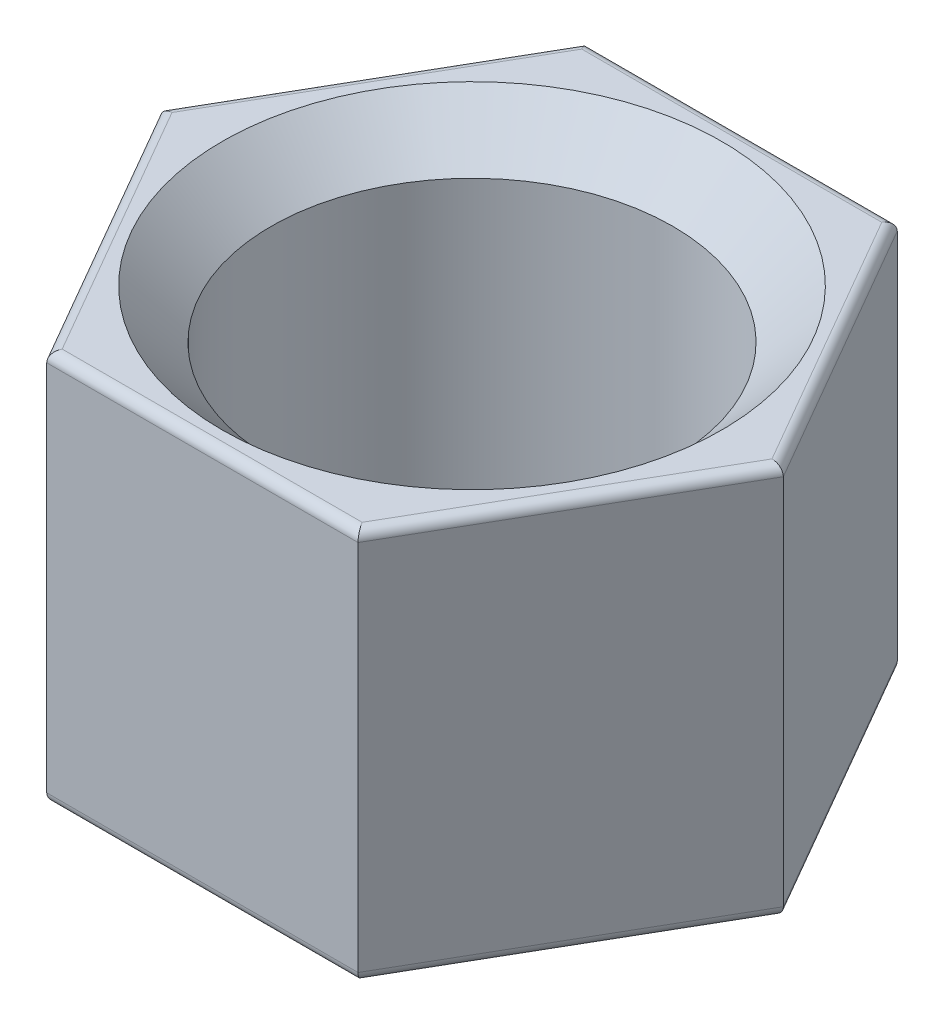
ISO-10303-21;
HEADER;
FILE_DESCRIPTION(('STEP AP214'),'2;1');
FILE_NAME('part.step','',(''),(''),'','','');
FILE_SCHEMA(('AUTOMOTIVE_DESIGN { 1 0 10303 214 1 1 1 1 }'));
ENDSEC;
DATA;
#1=APPLICATION_CONTEXT('core data for automotive mechanical design processes');
#2=APPLICATION_PROTOCOL_DEFINITION('international standard','automotive_design',2000,#1);
#3=PRODUCT_CONTEXT('',#1,'mechanical');
#4=PRODUCT('Part','Part','',(#3));
#5=PRODUCT_RELATED_PRODUCT_CATEGORY('part','',(#4));
#6=PRODUCT_DEFINITION_FORMATION('','',#4);
#7=PRODUCT_DEFINITION_CONTEXT('part definition',#1,'design');
#8=PRODUCT_DEFINITION('design','',#6,#7);
#9=PRODUCT_DEFINITION_SHAPE('','',#8);
#10=(LENGTH_UNIT() NAMED_UNIT(*) SI_UNIT(.MILLI.,.METRE.));
#11=(NAMED_UNIT(*) PLANE_ANGLE_UNIT() SI_UNIT($,.RADIAN.));
#12=(NAMED_UNIT(*) SI_UNIT($,.STERADIAN.) SOLID_ANGLE_UNIT());
#13=UNCERTAINTY_MEASURE_WITH_UNIT(LENGTH_MEASURE(1.E-05),#10,'distance_accuracy_value','');
#14=(GEOMETRIC_REPRESENTATION_CONTEXT(3) GLOBAL_UNCERTAINTY_ASSIGNED_CONTEXT((#13)) GLOBAL_UNIT_ASSIGNED_CONTEXT((#10,
#11,#12)) REPRESENTATION_CONTEXT('',''));
#15=CARTESIAN_POINT('',(0.,0.,0.));
#16=DIRECTION('',(0.,0.,1.));
#17=DIRECTION('',(1.,0.,0.));
#18=AXIS2_PLACEMENT_3D('',#15,#16,#17);
#19=CARTESIAN_POINT('',(0.794224291453835,2.,1.3756368254034));
#20=DIRECTION('',(-0.866025403784442,0.,-0.499999999999995));
#21=DIRECTION('',(-0.499999999999995,0.,0.866025403784442));
#22=AXIS2_PLACEMENT_3D('',#19,#20,#21);
#23=PLANE('',#22);
#24=DIRECTION('',(0.,-1.,0.));
#25=VECTOR('',#24,1.);
#26=CARTESIAN_POINT('',(0.794224291453835,2.,1.3756368254034));
#27=LINE('',#26,#25);
#28=CARTESIAN_POINT('',(0.794224291453835,1.95,1.3756368254034));
#29=VERTEX_POINT('',#28);
#30=CARTESIAN_POINT('',(0.794224291453835,0.0499999999999999,1.3756368254034));
#31=VERTEX_POINT('',#30);
#32=EDGE_CURVE('E296',#29,#31,#27,.T.);
#33=ORIENTED_EDGE('',*,*,#32,.T.);
#34=DIRECTION('',(0.499999999999995,0.,-0.866025403784442));
#35=VECTOR('',#34,1.);
#36=CARTESIAN_POINT('',(0.794224291453835,0.0499999999999999,1.3756368254034));
#37=LINE('',#36,#35);
#38=CARTESIAN_POINT('',(1.58844858290764,0.0499999999999999,0.));
#39=VERTEX_POINT('',#38);
#40=EDGE_CURVE('E218',#31,#39,#37,.T.);
#41=ORIENTED_EDGE('',*,*,#40,.T.);
#42=DIRECTION('',(0.,-1.,0.));
#43=VECTOR('',#42,1.);
#44=CARTESIAN_POINT('',(1.58844858290764,2.,0.));
#45=LINE('',#44,#43);
#46=CARTESIAN_POINT('',(1.58844858290764,1.95,0.));
#47=VERTEX_POINT('',#46);
#48=EDGE_CURVE('E165',#47,#39,#45,.T.);
#49=ORIENTED_EDGE('',*,*,#48,.F.);
#50=DIRECTION('',(0.499999999999995,0.,-0.866025403784442));
#51=VECTOR('',#50,1.);
#52=CARTESIAN_POINT('',(0.794224291453835,1.95,1.3756368254034));
#53=LINE('',#52,#51);
#54=EDGE_CURVE('E262',#47,#29,#53,.F.);
#55=ORIENTED_EDGE('',*,*,#54,.T.);
#56=EDGE_LOOP('',(#33,#41,#49,#55));
#57=FACE_BOUND('',#56,.T.);
#58=ADVANCED_FACE('F49',(#57),#23,.F.);
#59=CARTESIAN_POINT('',(1.58844858290764,2.,0.));
#60=DIRECTION('',(-0.866025403784438,0.,0.500000000000001));
#61=DIRECTION('',(0.500000000000001,0.,0.866025403784438));
#62=AXIS2_PLACEMENT_3D('',#59,#60,#61);
#63=PLANE('',#62);
#64=ORIENTED_EDGE('',*,*,#48,.T.);
#65=DIRECTION('',(-0.500000000000001,0.,-0.866025403784438));
#66=VECTOR('',#65,1.);
#67=CARTESIAN_POINT('',(1.58844858290764,0.0499999999999999,0.));
#68=LINE('',#67,#66);
#69=CARTESIAN_POINT('',(0.794224291453816,0.0499999999999999,-1.37563682540341));
#70=VERTEX_POINT('',#69);
#71=EDGE_CURVE('E215',#39,#70,#68,.T.);
#72=ORIENTED_EDGE('',*,*,#71,.T.);
#73=DIRECTION('',(0.,-1.,0.));
#74=VECTOR('',#73,1.);
#75=CARTESIAN_POINT('',(0.794224291453816,2.,-1.37563682540341));
#76=LINE('',#75,#74);
#77=CARTESIAN_POINT('',(0.794224291453816,1.95,-1.37563682540341));
#78=VERTEX_POINT('',#77);
#79=EDGE_CURVE('E282',#78,#70,#76,.T.);
#80=ORIENTED_EDGE('',*,*,#79,.F.);
#81=DIRECTION('',(-0.500000000000001,0.,-0.866025403784438));
#82=VECTOR('',#81,1.);
#83=CARTESIAN_POINT('',(1.58844858290764,1.95,0.));
#84=LINE('',#83,#82);
#85=EDGE_CURVE('E265',#78,#47,#84,.F.);
#86=ORIENTED_EDGE('',*,*,#85,.T.);
#87=EDGE_LOOP('',(#64,#72,#80,#86));
#88=FACE_BOUND('',#87,.T.);
#89=ADVANCED_FACE('F329',(#88),#63,.F.);
#90=CARTESIAN_POINT('',(0.794224291453816,2.,-1.37563682540341));
#91=DIRECTION('',(0.,0.,1.));
#92=DIRECTION('',(1.,0.,0.));
#93=AXIS2_PLACEMENT_3D('',#90,#91,#92);
#94=PLANE('',#93);
#95=ORIENTED_EDGE('',*,*,#79,.T.);
#96=DIRECTION('',(-1.,0.,0.));
#97=VECTOR('',#96,1.);
#98=CARTESIAN_POINT('',(0.794224291453816,0.0499999999999999,-1.37563682540341));
#99=LINE('',#98,#97);
#100=CARTESIAN_POINT('',(-0.794224291453825,0.0499999999999999,-1.3756368254034));
#101=VERTEX_POINT('',#100);
#102=EDGE_CURVE('E212',#70,#101,#99,.T.);
#103=ORIENTED_EDGE('',*,*,#102,.T.);
#104=DIRECTION('',(0.,-1.,0.));
#105=VECTOR('',#104,1.);
#106=CARTESIAN_POINT('',(-0.794224291453825,2.,-1.3756368254034));
#107=LINE('',#106,#105);
#108=CARTESIAN_POINT('',(-0.794224291453825,1.95,-1.3756368254034));
#109=VERTEX_POINT('',#108);
#110=EDGE_CURVE('E286',#109,#101,#107,.T.);
#111=ORIENTED_EDGE('',*,*,#110,.F.);
#112=DIRECTION('',(-1.,0.,0.));
#113=VECTOR('',#112,1.);
#114=CARTESIAN_POINT('',(0.794224291453816,1.95,-1.37563682540341));
#115=LINE('',#114,#113);
#116=EDGE_CURVE('E168',#109,#78,#115,.F.);
#117=ORIENTED_EDGE('',*,*,#116,.T.);
#118=EDGE_LOOP('',(#95,#103,#111,#117));
#119=FACE_BOUND('',#118,.T.);
#120=ADVANCED_FACE('F336',(#119),#94,.F.);
#121=CARTESIAN_POINT('',(-0.794224291453825,2.,-1.3756368254034));
#122=DIRECTION('',(0.866025403784441,0.,0.499999999999995));
#123=DIRECTION('',(0.499999999999995,0.,-0.866025403784442));
#124=AXIS2_PLACEMENT_3D('',#121,#122,#123);
#125=PLANE('',#124);
#126=ORIENTED_EDGE('',*,*,#110,.T.);
#127=DIRECTION('',(-0.499999999999995,0.,0.866025403784442));
#128=VECTOR('',#127,1.);
#129=CARTESIAN_POINT('',(-0.794224291453825,0.0499999999999999,-1.3756368254034));
#130=LINE('',#129,#128);
#131=CARTESIAN_POINT('',(-1.58844858290764,0.0499999999999999,0.));
#132=VERTEX_POINT('',#131);
#133=EDGE_CURVE('E188',#101,#132,#130,.T.);
#134=ORIENTED_EDGE('',*,*,#133,.T.);
#135=DIRECTION('',(0.,-1.,0.));
#136=VECTOR('',#135,1.);
#137=CARTESIAN_POINT('',(-1.58844858290764,2.,0.));
#138=LINE('',#137,#136);
#139=CARTESIAN_POINT('',(-1.58844858290764,1.95,0.));
#140=VERTEX_POINT('',#139);
#141=EDGE_CURVE('E290',#140,#132,#138,.T.);
#142=ORIENTED_EDGE('',*,*,#141,.F.);
#143=DIRECTION('',(-0.499999999999995,0.,0.866025403784442));
#144=VECTOR('',#143,1.);
#145=CARTESIAN_POINT('',(-0.794224291453825,1.95,-1.3756368254034));
#146=LINE('',#145,#144);
#147=EDGE_CURVE('E193',#140,#109,#146,.F.);
#148=ORIENTED_EDGE('',*,*,#147,.T.);
#149=EDGE_LOOP('',(#126,#134,#142,#148));
#150=FACE_BOUND('',#149,.T.);
#151=ADVANCED_FACE('F395',(#150),#125,.F.);
#152=CARTESIAN_POINT('',(-1.58844858290764,2.,0.));
#153=DIRECTION('',(0.866025403784435,0.,-0.500000000000007));
#154=DIRECTION('',(-0.500000000000007,0.,-0.866025403784435));
#155=AXIS2_PLACEMENT_3D('',#152,#153,#154);
#156=PLANE('',#155);
#157=ORIENTED_EDGE('',*,*,#141,.T.);
#158=DIRECTION('',(0.500000000000007,0.,0.866025403784435));
#159=VECTOR('',#158,1.);
#160=CARTESIAN_POINT('',(-1.58844858290764,0.0499999999999999,0.));
#161=LINE('',#160,#159);
#162=CARTESIAN_POINT('',(-0.794224291453806,0.0499999999999999,1.37563682540341));
#163=VERTEX_POINT('',#162);
#164=EDGE_CURVE('E11',#132,#163,#161,.T.);
#165=ORIENTED_EDGE('',*,*,#164,.T.);
#166=DIRECTION('',(0.,-1.,0.));
#167=VECTOR('',#166,1.);
#168=CARTESIAN_POINT('',(-0.794224291453806,2.,1.37563682540341));
#169=LINE('',#168,#167);
#170=CARTESIAN_POINT('',(-0.794224291453806,1.95,1.37563682540341));
#171=VERTEX_POINT('',#170);
#172=EDGE_CURVE('E293',#171,#163,#169,.T.);
#173=ORIENTED_EDGE('',*,*,#172,.F.);
#174=DIRECTION('',(0.500000000000007,0.,0.866025403784435));
#175=VECTOR('',#174,1.);
#176=CARTESIAN_POINT('',(-1.58844858290764,1.95,0.));
#177=LINE('',#176,#175);
#178=EDGE_CURVE('E256',#171,#140,#177,.F.);
#179=ORIENTED_EDGE('',*,*,#178,.T.);
#180=EDGE_LOOP('',(#157,#165,#173,#179));
#181=FACE_BOUND('',#180,.T.);
#182=ADVANCED_FACE('F325',(#181),#156,.F.);
#183=CARTESIAN_POINT('',(-0.794224291453806,2.,1.37563682540341));
#184=DIRECTION('',(0.,0.,-1.));
#185=DIRECTION('',(-1.,0.,0.));
#186=AXIS2_PLACEMENT_3D('',#183,#184,#185);
#187=PLANE('',#186);
#188=ORIENTED_EDGE('',*,*,#172,.T.);
#189=DIRECTION('',(1.,0.,0.));
#190=VECTOR('',#189,1.);
#191=CARTESIAN_POINT('',(-0.794224291453806,0.0499999999999999,1.37563682540341));
#192=LINE('',#191,#190);
#193=EDGE_CURVE('E59',#163,#31,#192,.T.);
#194=ORIENTED_EDGE('',*,*,#193,.T.);
#195=ORIENTED_EDGE('',*,*,#32,.F.);
#196=DIRECTION('',(1.,0.,0.));
#197=VECTOR('',#196,1.);
#198=CARTESIAN_POINT('',(-0.794224291453806,1.95,1.37563682540341));
#199=LINE('',#198,#197);
#200=EDGE_CURVE('E259',#29,#171,#199,.F.);
#201=ORIENTED_EDGE('',*,*,#200,.T.);
#202=EDGE_LOOP('',(#188,#194,#195,#201));
#203=FACE_BOUND('',#202,.T.);
#204=ADVANCED_FACE('F314',(#203),#187,.F.);
#205=CARTESIAN_POINT('',(0.,2.,0.));
#206=DIRECTION('',(0.,1.,0.));
#207=DIRECTION('',(0.,0.,1.));
#208=AXIS2_PLACEMENT_3D('',#205,#206,#207);
#209=PLANE('',#208);
#210=DIRECTION('',(0.499999999999995,0.,-0.866025403784442));
#211=VECTOR('',#210,1.);
#212=CARTESIAN_POINT('',(1.54514731271842,2.,-0.0249999999999998));
#213=LINE('',#212,#211);
#214=CARTESIAN_POINT('',(0.765356777994353,2.,1.3256368254034));
#215=VERTEX_POINT('',#214);
#216=CARTESIAN_POINT('',(1.53071355598868,2.,0.));
#217=VERTEX_POINT('',#216);
#218=EDGE_CURVE('E271',#215,#217,#213,.T.);
#219=ORIENTED_EDGE('',*,*,#218,.T.);
#220=DIRECTION('',(-0.500000000000001,0.,-0.866025403784438));
#221=VECTOR('',#220,1.);
#222=CARTESIAN_POINT('',(0.750923021264594,2.,-1.35063682540341));
#223=LINE('',#222,#221);
#224=CARTESIAN_POINT('',(0.765356777994335,2.,-1.32563682540341));
#225=VERTEX_POINT('',#224);
#226=EDGE_CURVE('E148',#217,#225,#223,.T.);
#227=ORIENTED_EDGE('',*,*,#226,.T.);
#228=DIRECTION('',(-1.,0.,0.));
#229=VECTOR('',#228,1.);
#230=CARTESIAN_POINT('',(-0.794224291453825,2.,-1.3256368254034));
#231=LINE('',#230,#229);
#232=CARTESIAN_POINT('',(-0.765356777994343,2.,-1.3256368254034));
#233=VERTEX_POINT('',#232);
#234=EDGE_CURVE('E141',#225,#233,#231,.T.);
#235=ORIENTED_EDGE('',*,*,#234,.T.);
#236=DIRECTION('',(-0.499999999999995,0.,0.866025403784442));
#237=VECTOR('',#236,1.);
#238=CARTESIAN_POINT('',(-1.54514731271842,2.,0.0250000000000112));
#239=LINE('',#238,#237);
#240=CARTESIAN_POINT('',(-1.53071355598868,2.,0.));
#241=VERTEX_POINT('',#240);
#242=EDGE_CURVE('E145',#233,#241,#239,.T.);
#243=ORIENTED_EDGE('',*,*,#242,.T.);
#244=DIRECTION('',(0.500000000000007,0.,0.866025403784435));
#245=VECTOR('',#244,1.);
#246=CARTESIAN_POINT('',(-0.750923021264584,2.,1.35063682540341));
#247=LINE('',#246,#245);
#248=CARTESIAN_POINT('',(-0.765356777994325,2.,1.32563682540341));
#249=VERTEX_POINT('',#248);
#250=EDGE_CURVE('E153',#241,#249,#247,.T.);
#251=ORIENTED_EDGE('',*,*,#250,.T.);
#252=DIRECTION('',(1.,0.,0.));
#253=VECTOR('',#252,1.);
#254=CARTESIAN_POINT('',(0.794224291453834,2.,1.3256368254034));
#255=LINE('',#254,#253);
#256=EDGE_CURVE('E274',#249,#215,#255,.T.);
#257=ORIENTED_EDGE('',*,*,#256,.T.);
#258=EDGE_LOOP('',(#219,#227,#235,#243,#251,#257));
#259=FACE_BOUND('',#258,.T.);
#260=CARTESIAN_POINT('',(0.,2.,0.));
#261=DIRECTION('',(0.,1.,0.));
#262=DIRECTION('',(0.,0.,1.));
#263=AXIS2_PLACEMENT_3D('',#260,#261,#262);
#264=CIRCLE('',#263,1.275);
#265=CARTESIAN_POINT('',(0.,2.,1.275));
#266=VERTEX_POINT('',#265);
#267=EDGE_CURVE('E187',#266,#266,#264,.T.);
#268=ORIENTED_EDGE('',*,*,#267,.F.);
#269=EDGE_LOOP('',(#268));
#270=FACE_BOUND('',#269,.T.);
#271=ADVANCED_FACE('F143',(#259,#270),#209,.T.);
#272=CARTESIAN_POINT('',(0.,0.,0.));
#273=DIRECTION('',(0.,1.,0.));
#274=DIRECTION('',(0.,0.,1.));
#275=AXIS2_PLACEMENT_3D('',#272,#273,#274);
#276=PLANE('',#275);
#277=DIRECTION('',(0.500000000000007,0.,0.866025403784435));
#278=VECTOR('',#277,1.);
#279=CARTESIAN_POINT('',(-1.1480351669915,0.,0.662818412701712));
#280=LINE('',#279,#278);
#281=CARTESIAN_POINT('',(-0.765356777994325,0.,1.32563682540341));
#282=VERTEX_POINT('',#281);
#283=CARTESIAN_POINT('',(-1.53071355598868,0.,0.));
#284=VERTEX_POINT('',#283);
#285=EDGE_CURVE('E192',#282,#284,#280,.F.);
#286=ORIENTED_EDGE('',*,*,#285,.T.);
#287=DIRECTION('',(-0.499999999999995,0.,0.866025403784442));
#288=VECTOR('',#287,1.);
#289=CARTESIAN_POINT('',(-1.14803516699151,0.,-0.662818412701696));
#290=LINE('',#289,#288);
#291=CARTESIAN_POINT('',(-0.765356777994344,0.,-1.3256368254034));
#292=VERTEX_POINT('',#291);
#293=EDGE_CURVE('E208',#284,#292,#290,.F.);
#294=ORIENTED_EDGE('',*,*,#293,.T.);
#295=DIRECTION('',(-1.,0.,0.));
#296=VECTOR('',#295,1.);
#297=CARTESIAN_POINT('',(0.,0.,-1.32563682540341));
#298=LINE('',#297,#296);
#299=CARTESIAN_POINT('',(0.765356777994335,0.,-1.32563682540341));
#300=VERTEX_POINT('',#299);
#301=EDGE_CURVE('E205',#292,#300,#298,.F.);
#302=ORIENTED_EDGE('',*,*,#301,.T.);
#303=DIRECTION('',(-0.500000000000001,0.,-0.866025403784438));
#304=VECTOR('',#303,1.);
#305=CARTESIAN_POINT('',(1.1480351669915,0.,-0.662818412701704));
#306=LINE('',#305,#304);
#307=CARTESIAN_POINT('',(1.53071355598868,0.,0.));
#308=VERTEX_POINT('',#307);
#309=EDGE_CURVE('E202',#300,#308,#306,.F.);
#310=ORIENTED_EDGE('',*,*,#309,.T.);
#311=DIRECTION('',(0.499999999999995,0.,-0.866025403784442));
#312=VECTOR('',#311,1.);
#313=CARTESIAN_POINT('',(1.14803516699151,0.,0.662818412701699));
#314=LINE('',#313,#312);
#315=CARTESIAN_POINT('',(0.765356777994353,0.,1.3256368254034));
#316=VERTEX_POINT('',#315);
#317=EDGE_CURVE('E199',#308,#316,#314,.F.);
#318=ORIENTED_EDGE('',*,*,#317,.T.);
#319=DIRECTION('',(1.,0.,0.));
#320=VECTOR('',#319,1.);
#321=CARTESIAN_POINT('',(0.,0.,1.32563682540341));
#322=LINE('',#321,#320);
#323=EDGE_CURVE('E196',#316,#282,#322,.F.);
#324=ORIENTED_EDGE('',*,*,#323,.T.);
#325=EDGE_LOOP('',(#286,#294,#302,#310,#318,#324));
#326=FACE_BOUND('',#325,.T.);
#327=CARTESIAN_POINT('',(0.,0.,0.));
#328=DIRECTION('',(0.,1.,0.));
#329=DIRECTION('',(0.,0.,1.));
#330=AXIS2_PLACEMENT_3D('',#327,#328,#329);
#331=CIRCLE('',#330,1.025);
#332=CARTESIAN_POINT('',(0.,0.,1.025));
#333=VERTEX_POINT('',#332);
#334=EDGE_CURVE('E299',#333,#333,#331,.T.);
#335=ORIENTED_EDGE('',*,*,#334,.T.);
#336=EDGE_LOOP('',(#335));
#337=FACE_BOUND('',#336,.T.);
#338=ADVANCED_FACE('F313',(#326,#337),#276,.F.);
#339=CARTESIAN_POINT('',(0.,2.,0.));
#340=DIRECTION('',(0.,1.,0.));
#341=DIRECTION('',(0.,0.,1.));
#342=AXIS2_PLACEMENT_3D('',#339,#340,#341);
#343=CYLINDRICAL_SURFACE('',#342,1.025);
#344=ORIENTED_EDGE('',*,*,#334,.F.);
#345=EDGE_LOOP('',(#344));
#346=FACE_BOUND('',#345,.T.);
#347=CARTESIAN_POINT('',(0.,1.75,0.));
#348=DIRECTION('',(0.,1.,0.));
#349=DIRECTION('',(0.,0.,1.));
#350=AXIS2_PLACEMENT_3D('',#347,#348,#349);
#351=CIRCLE('',#350,1.025);
#352=CARTESIAN_POINT('',(0.,1.75,1.025));
#353=VERTEX_POINT('',#352);
#354=EDGE_CURVE('E303',#353,#353,#351,.T.);
#355=ORIENTED_EDGE('',*,*,#354,.T.);
#356=EDGE_LOOP('',(#355));
#357=FACE_BOUND('',#356,.T.);
#358=ADVANCED_FACE('F321',(#346,#357),#343,.F.);
#359=CARTESIAN_POINT('',(0.,2.,0.));
#360=DIRECTION('',(0.,1.,0.));
#361=DIRECTION('',(0.,0.,1.));
#362=AXIS2_PLACEMENT_3D('',#359,#360,#361);
#363=CONICAL_SURFACE('',#362,1.275,0.785398163397449);
#364=ORIENTED_EDGE('',*,*,#354,.F.);
#365=EDGE_LOOP('',(#364));
#366=FACE_BOUND('',#365,.T.);
#367=ORIENTED_EDGE('',*,*,#267,.T.);
#368=EDGE_LOOP('',(#367));
#369=FACE_BOUND('',#368,.T.);
#370=ADVANCED_FACE('F311',(#366,#369),#363,.F.);
#371=CARTESIAN_POINT('',(-1.1480351669915,1.95,0.662818412701712));
#372=DIRECTION('',(-0.500000000000007,0.,-0.866025403784435));
#373=DIRECTION('',(-0.866025403784435,0.,0.500000000000007));
#374=AXIS2_PLACEMENT_3D('',#371,#372,#373);
#375=CYLINDRICAL_SURFACE('',#374,0.05);
#376=CARTESIAN_POINT('',(-1.53071355598868,1.95,0.));
#377=DIRECTION('',(0.,0.,-1.));
#378=DIRECTION('',(1.,0.,0.));
#379=AXIS2_PLACEMENT_3D('',#376,#377,#378);
#380=ELLIPSE('',#379,0.0577350269189626,0.05);
#381=EDGE_CURVE('E163',#140,#241,#380,.T.);
#382=ORIENTED_EDGE('',*,*,#381,.F.);
#383=ORIENTED_EDGE('',*,*,#178,.F.);
#384=CARTESIAN_POINT('',(-0.765356777994325,1.95,1.32563682540341));
#385=DIRECTION('',(-0.866025403784443,0.,-0.499999999999992));
#386=DIRECTION('',(0.499999999999992,0.,-0.866025403784443));
#387=AXIS2_PLACEMENT_3D('',#384,#385,#386);
#388=ELLIPSE('',#387,0.0577350269189626,0.05);
#389=EDGE_CURVE('E183',#249,#171,#388,.F.);
#390=ORIENTED_EDGE('',*,*,#389,.F.);
#391=ORIENTED_EDGE('',*,*,#250,.F.);
#392=EDGE_LOOP('',(#382,#383,#390,#391));
#393=FACE_BOUND('',#392,.T.);
#394=ADVANCED_FACE('F354',(#393),#375,.T.);
#395=CARTESIAN_POINT('',(0.,1.95,1.32563682540341));
#396=DIRECTION('',(-1.,0.,0.));
#397=DIRECTION('',(0.,0.,1.));
#398=AXIS2_PLACEMENT_3D('',#395,#396,#397);
#399=CYLINDRICAL_SURFACE('',#398,0.05);
#400=ORIENTED_EDGE('',*,*,#389,.T.);
#401=ORIENTED_EDGE('',*,*,#200,.F.);
#402=CARTESIAN_POINT('',(0.765356777994353,1.95,1.3256368254034));
#403=DIRECTION('',(-0.866025403784435,0.,0.500000000000007));
#404=DIRECTION('',(-0.500000000000007,0.,-0.866025403784435));
#405=AXIS2_PLACEMENT_3D('',#402,#403,#404);
#406=ELLIPSE('',#405,0.0577350269189625,0.05);
#407=EDGE_CURVE('E170',#215,#29,#406,.F.);
#408=ORIENTED_EDGE('',*,*,#407,.F.);
#409=ORIENTED_EDGE('',*,*,#256,.F.);
#410=EDGE_LOOP('',(#400,#401,#408,#409));
#411=FACE_BOUND('',#410,.T.);
#412=ADVANCED_FACE('F351',(#411),#399,.T.);
#413=CARTESIAN_POINT('',(-1.14803516699151,1.95,-0.662818412701696));
#414=DIRECTION('',(0.499999999999995,0.,-0.866025403784442));
#415=DIRECTION('',(-0.866025403784441,0.,-0.499999999999995));
#416=AXIS2_PLACEMENT_3D('',#413,#414,#415);
#417=CYLINDRICAL_SURFACE('',#416,0.05);
#418=ORIENTED_EDGE('',*,*,#381,.T.);
#419=ORIENTED_EDGE('',*,*,#242,.F.);
#420=CARTESIAN_POINT('',(-0.765356777994343,1.95,-1.3256368254034));
#421=DIRECTION('',(0.866025403784436,0.,-0.500000000000004));
#422=DIRECTION('',(-0.500000000000004,0.,-0.866025403784436));
#423=AXIS2_PLACEMENT_3D('',#420,#421,#422);
#424=ELLIPSE('',#423,0.0577350269189626,0.05);
#425=EDGE_CURVE('E160',#109,#233,#424,.T.);
#426=ORIENTED_EDGE('',*,*,#425,.F.);
#427=ORIENTED_EDGE('',*,*,#147,.F.);
#428=EDGE_LOOP('',(#418,#419,#426,#427));
#429=FACE_BOUND('',#428,.T.);
#430=ADVANCED_FACE('F158',(#429),#417,.T.);
#431=CARTESIAN_POINT('',(1.14803516699151,1.95,0.662818412701699));
#432=DIRECTION('',(-0.499999999999995,0.,0.866025403784442));
#433=DIRECTION('',(0.866025403784442,0.,0.499999999999995));
#434=AXIS2_PLACEMENT_3D('',#431,#432,#433);
#435=CYLINDRICAL_SURFACE('',#434,0.05);
#436=ORIENTED_EDGE('',*,*,#407,.T.);
#437=ORIENTED_EDGE('',*,*,#54,.F.);
#438=CARTESIAN_POINT('',(1.53071355598868,1.95,0.));
#439=DIRECTION('',(0.,0.,1.));
#440=DIRECTION('',(-1.,0.,0.));
#441=AXIS2_PLACEMENT_3D('',#438,#439,#440);
#442=ELLIPSE('',#441,0.0577350269189625,0.05);
#443=EDGE_CURVE('E171',#217,#47,#442,.F.);
#444=ORIENTED_EDGE('',*,*,#443,.F.);
#445=ORIENTED_EDGE('',*,*,#218,.F.);
#446=EDGE_LOOP('',(#436,#437,#444,#445));
#447=FACE_BOUND('',#446,.T.);
#448=ADVANCED_FACE('F345',(#447),#435,.T.);
#449=CARTESIAN_POINT('',(0.,1.95,-1.32563682540341));
#450=DIRECTION('',(1.,0.,0.));
#451=DIRECTION('',(0.,0.,-1.));
#452=AXIS2_PLACEMENT_3D('',#449,#450,#451);
#453=CYLINDRICAL_SURFACE('',#452,0.05);
#454=ORIENTED_EDGE('',*,*,#425,.T.);
#455=ORIENTED_EDGE('',*,*,#234,.F.);
#456=CARTESIAN_POINT('',(0.765356777994334,1.95,-1.32563682540341));
#457=DIRECTION('',(0.86602540378444,0.,0.499999999999998));
#458=DIRECTION('',(0.499999999999998,0.,-0.86602540378444));
#459=AXIS2_PLACEMENT_3D('',#456,#457,#458);
#460=ELLIPSE('',#459,0.0577350269189626,0.05);
#461=EDGE_CURVE('E177',#78,#225,#460,.T.);
#462=ORIENTED_EDGE('',*,*,#461,.F.);
#463=ORIENTED_EDGE('',*,*,#116,.F.);
#464=EDGE_LOOP('',(#454,#455,#462,#463));
#465=FACE_BOUND('',#464,.T.);
#466=ADVANCED_FACE('F167',(#465),#453,.T.);
#467=CARTESIAN_POINT('',(1.1480351669915,1.95,-0.662818412701704));
#468=DIRECTION('',(0.500000000000001,0.,0.866025403784438));
#469=DIRECTION('',(0.866025403784438,0.,-0.500000000000001));
#470=AXIS2_PLACEMENT_3D('',#467,#468,#469);
#471=CYLINDRICAL_SURFACE('',#470,0.05);
#472=ORIENTED_EDGE('',*,*,#443,.T.);
#473=ORIENTED_EDGE('',*,*,#85,.F.);
#474=ORIENTED_EDGE('',*,*,#461,.T.);
#475=ORIENTED_EDGE('',*,*,#226,.F.);
#476=EDGE_LOOP('',(#472,#473,#474,#475));
#477=FACE_BOUND('',#476,.T.);
#478=ADVANCED_FACE('F341',(#477),#471,.T.);
#479=CARTESIAN_POINT('',(0.750923021264613,0.0499999999999999,1.3506368254034));
#480=DIRECTION('',(0.499999999999995,0.,-0.866025403784442));
#481=DIRECTION('',(-0.866025403784442,0.,-0.499999999999995));
#482=AXIS2_PLACEMENT_3D('',#479,#480,#481);
#483=CYLINDRICAL_SURFACE('',#482,0.05);
#484=CARTESIAN_POINT('',(0.765356777994353,0.0499999999999999,1.3256368254034));
#485=DIRECTION('',(0.866025403784435,0.,-0.500000000000007));
#486=DIRECTION('',(0.500000000000007,0.,0.866025403784435));
#487=AXIS2_PLACEMENT_3D('',#484,#485,#486);
#488=ELLIPSE('',#487,0.0577350269189625,0.05);
#489=EDGE_CURVE('E236',#316,#31,#488,.F.);
#490=ORIENTED_EDGE('',*,*,#489,.F.);
#491=ORIENTED_EDGE('',*,*,#317,.F.);
#492=CARTESIAN_POINT('',(1.53071355598868,0.0499999999999999,0.));
#493=DIRECTION('',(0.,0.,-1.));
#494=DIRECTION('',(1.,0.,0.));
#495=AXIS2_PLACEMENT_3D('',#492,#493,#494);
#496=ELLIPSE('',#495,0.0577350269189625,0.05);
#497=EDGE_CURVE('E53',#39,#308,#496,.T.);
#498=ORIENTED_EDGE('',*,*,#497,.F.);
#499=ORIENTED_EDGE('',*,*,#40,.F.);
#500=EDGE_LOOP('',(#490,#491,#498,#499));
#501=FACE_BOUND('',#500,.T.);
#502=ADVANCED_FACE('F51',(#501),#483,.T.);
#503=CARTESIAN_POINT('',(1.54514731271842,0.0499999999999999,0.0250000000000001));
#504=DIRECTION('',(-0.500000000000001,0.,-0.866025403784438));
#505=DIRECTION('',(-0.866025403784438,0.,0.500000000000001));
#506=AXIS2_PLACEMENT_3D('',#503,#504,#505);
#507=CYLINDRICAL_SURFACE('',#506,0.05);
#508=ORIENTED_EDGE('',*,*,#497,.T.);
#509=ORIENTED_EDGE('',*,*,#309,.F.);
#510=CARTESIAN_POINT('',(0.765356777994335,0.0499999999999999,-1.32563682540341));
#511=DIRECTION('',(-0.86602540378444,0.,-0.499999999999998));
#512=DIRECTION('',(0.499999999999998,0.,-0.86602540378444));
#513=AXIS2_PLACEMENT_3D('',#510,#511,#512);
#514=ELLIPSE('',#513,0.0577350269189626,0.05);
#515=EDGE_CURVE('E233',#70,#300,#514,.T.);
#516=ORIENTED_EDGE('',*,*,#515,.F.);
#517=ORIENTED_EDGE('',*,*,#71,.F.);
#518=EDGE_LOOP('',(#508,#509,#516,#517));
#519=FACE_BOUND('',#518,.T.);
#520=ADVANCED_FACE('F372',(#519),#507,.T.);
#521=CARTESIAN_POINT('',(-0.794224291453807,0.0499999999999999,1.32563682540341));
#522=DIRECTION('',(1.,0.,0.));
#523=DIRECTION('',(0.,0.,-1.));
#524=AXIS2_PLACEMENT_3D('',#521,#522,#523);
#525=CYLINDRICAL_SURFACE('',#524,0.05);
#526=ORIENTED_EDGE('',*,*,#489,.T.);
#527=ORIENTED_EDGE('',*,*,#193,.F.);
#528=CARTESIAN_POINT('',(-0.765356777994325,0.0499999999999999,1.32563682540341));
#529=DIRECTION('',(0.866025403784443,0.,0.499999999999992));
#530=DIRECTION('',(-0.499999999999992,0.,0.866025403784443));
#531=AXIS2_PLACEMENT_3D('',#528,#529,#530);
#532=ELLIPSE('',#531,0.0577350269189626,0.05);
#533=EDGE_CURVE('E229',#282,#163,#532,.F.);
#534=ORIENTED_EDGE('',*,*,#533,.F.);
#535=ORIENTED_EDGE('',*,*,#323,.F.);
#536=EDGE_LOOP('',(#526,#527,#534,#535));
#537=FACE_BOUND('',#536,.T.);
#538=ADVANCED_FACE('F369',(#537),#525,.T.);
#539=CARTESIAN_POINT('',(0.794224291453816,0.0499999999999999,-1.32563682540341));
#540=DIRECTION('',(-1.,0.,0.));
#541=DIRECTION('',(0.,0.,1.));
#542=AXIS2_PLACEMENT_3D('',#539,#540,#541);
#543=CYLINDRICAL_SURFACE('',#542,0.05);
#544=ORIENTED_EDGE('',*,*,#515,.T.);
#545=ORIENTED_EDGE('',*,*,#301,.F.);
#546=CARTESIAN_POINT('',(-0.765356777994343,0.0499999999999999,-1.3256368254034));
#547=DIRECTION('',(-0.866025403784436,0.,0.500000000000004));
#548=DIRECTION('',(-0.500000000000004,0.,-0.866025403784436));
#549=AXIS2_PLACEMENT_3D('',#546,#547,#548);
#550=ELLIPSE('',#549,0.0577350269189626,0.05);
#551=EDGE_CURVE('E226',#101,#292,#550,.T.);
#552=ORIENTED_EDGE('',*,*,#551,.F.);
#553=ORIENTED_EDGE('',*,*,#102,.F.);
#554=EDGE_LOOP('',(#544,#545,#552,#553));
#555=FACE_BOUND('',#554,.T.);
#556=ADVANCED_FACE('F365',(#555),#543,.T.);
#557=CARTESIAN_POINT('',(-1.54514731271842,0.0499999999999999,-0.0249999999999893));
#558=DIRECTION('',(0.500000000000007,0.,0.866025403784435));
#559=DIRECTION('',(0.866025403784435,0.,-0.500000000000007));
#560=AXIS2_PLACEMENT_3D('',#557,#558,#559);
#561=CYLINDRICAL_SURFACE('',#560,0.05);
#562=ORIENTED_EDGE('',*,*,#533,.T.);
#563=ORIENTED_EDGE('',*,*,#164,.F.);
#564=CARTESIAN_POINT('',(-1.53071355598868,0.0499999999999999,0.));
#565=DIRECTION('',(0.,0.,1.));
#566=DIRECTION('',(1.,0.,0.));
#567=AXIS2_PLACEMENT_3D('',#564,#565,#566);
#568=ELLIPSE('',#567,0.0577350269189626,0.05);
#569=EDGE_CURVE('E223',#284,#132,#568,.F.);
#570=ORIENTED_EDGE('',*,*,#569,.F.);
#571=ORIENTED_EDGE('',*,*,#285,.F.);
#572=EDGE_LOOP('',(#562,#563,#570,#571));
#573=FACE_BOUND('',#572,.T.);
#574=ADVANCED_FACE('F361',(#573),#561,.T.);
#575=CARTESIAN_POINT('',(-0.750923021264603,0.0499999999999999,-1.3506368254034));
#576=DIRECTION('',(-0.499999999999995,0.,0.866025403784442));
#577=DIRECTION('',(0.866025403784441,0.,0.499999999999995));
#578=AXIS2_PLACEMENT_3D('',#575,#576,#577);
#579=CYLINDRICAL_SURFACE('',#578,0.05);
#580=ORIENTED_EDGE('',*,*,#551,.T.);
#581=ORIENTED_EDGE('',*,*,#293,.F.);
#582=ORIENTED_EDGE('',*,*,#569,.T.);
#583=ORIENTED_EDGE('',*,*,#133,.F.);
#584=EDGE_LOOP('',(#580,#581,#582,#583));
#585=FACE_BOUND('',#584,.T.);
#586=ADVANCED_FACE('F358',(#585),#579,.T.);
#587=CLOSED_SHELL('',(#58,#89,#120,#151,#182,#204,#271,#338,#358,#370,#394,#412,#430,#448,#466,
#478,#502,#520,#538,#556,#574,#586));
#588=MANIFOLD_SOLID_BREP('B2',#587);
#589=ADVANCED_BREP_SHAPE_REPRESENTATION('',(#18,#588),#14);
#590=SHAPE_DEFINITION_REPRESENTATION(#9,#589);
ENDSEC;
END-ISO-10303-21;
